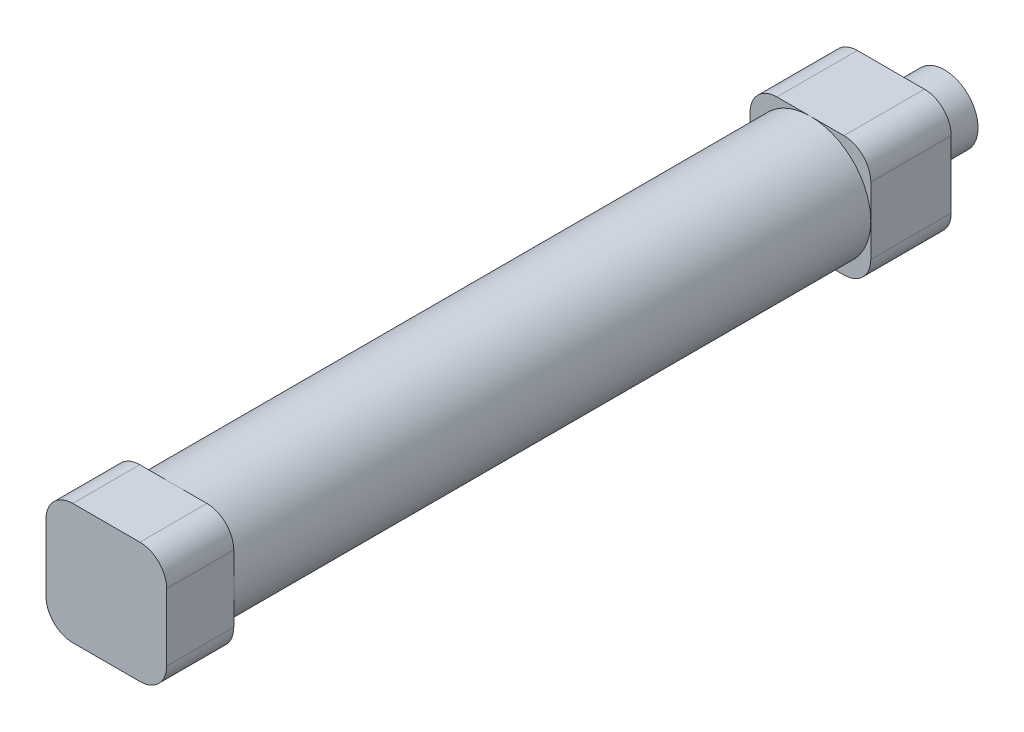
ISO-10303-21;
HEADER;
FILE_DESCRIPTION(('STEP AP214'),'2;1');
FILE_NAME('part.step','',(''),(''),'','','');
FILE_SCHEMA(('AUTOMOTIVE_DESIGN { 1 0 10303 214 1 1 1 1 }'));
ENDSEC;
DATA;
#1=APPLICATION_CONTEXT('core data for automotive mechanical design processes');
#2=APPLICATION_PROTOCOL_DEFINITION('international standard','automotive_design',2000,#1);
#3=PRODUCT_CONTEXT('',#1,'mechanical');
#4=PRODUCT('Part','Part','',(#3));
#5=PRODUCT_RELATED_PRODUCT_CATEGORY('part','',(#4));
#6=PRODUCT_DEFINITION_FORMATION('','',#4);
#7=PRODUCT_DEFINITION_CONTEXT('part definition',#1,'design');
#8=PRODUCT_DEFINITION('design','',#6,#7);
#9=PRODUCT_DEFINITION_SHAPE('','',#8);
#10=(LENGTH_UNIT() NAMED_UNIT(*) SI_UNIT(.MILLI.,.METRE.));
#11=(NAMED_UNIT(*) PLANE_ANGLE_UNIT() SI_UNIT($,.RADIAN.));
#12=(NAMED_UNIT(*) SI_UNIT($,.STERADIAN.) SOLID_ANGLE_UNIT());
#13=UNCERTAINTY_MEASURE_WITH_UNIT(LENGTH_MEASURE(1.E-05),#10,'distance_accuracy_value','');
#14=(GEOMETRIC_REPRESENTATION_CONTEXT(3) GLOBAL_UNCERTAINTY_ASSIGNED_CONTEXT((#13)) GLOBAL_UNIT_ASSIGNED_CONTEXT((#10,
#11,#12)) REPRESENTATION_CONTEXT('',''));
#15=CARTESIAN_POINT('',(0.,0.,0.));
#16=DIRECTION('',(0.,0.,1.));
#17=DIRECTION('',(1.,0.,0.));
#18=AXIS2_PLACEMENT_3D('',#15,#16,#17);
#19=CARTESIAN_POINT('',(4.99999999999999,-5.,0.));
#20=DIRECTION('',(0.,0.,-1.));
#21=DIRECTION('',(-1.,0.,0.));
#22=AXIS2_PLACEMENT_3D('',#19,#20,#21);
#23=PLANE('',#22);
#24=CARTESIAN_POINT('',(0.,0.,0.));
#25=DIRECTION('',(0.,0.,-1.));
#26=DIRECTION('',(-1.,0.,0.));
#27=AXIS2_PLACEMENT_3D('',#24,#25,#26);
#28=CIRCLE('',#27,2.5);
#29=CARTESIAN_POINT('',(-2.5,0.,0.));
#30=VERTEX_POINT('',#29);
#31=EDGE_CURVE('E39',#30,#30,#28,.T.);
#32=ORIENTED_EDGE('',*,*,#31,.T.);
#33=EDGE_LOOP('',(#32));
#34=FACE_BOUND('',#33,.T.);
#35=CARTESIAN_POINT('',(0.,0.,0.));
#36=DIRECTION('',(0.,0.,1.));
#37=DIRECTION('',(1.,0.,0.));
#38=AXIS2_PLACEMENT_3D('',#35,#36,#37);
#39=CIRCLE('',#38,8.);
#40=CARTESIAN_POINT('',(8.,0.,0.));
#41=VERTEX_POINT('',#40);
#42=EDGE_CURVE('E275',#41,#41,#39,.T.);
#43=ORIENTED_EDGE('',*,*,#42,.T.);
#44=EDGE_LOOP('',(#43));
#45=FACE_BOUND('',#44,.T.);
#46=ADVANCED_FACE('F35',(#34,#45),#23,.F.);
#47=CARTESIAN_POINT('',(-5.,5.,95.));
#48=DIRECTION('',(0.,0.,1.));
#49=DIRECTION('',(1.,0.,0.));
#50=AXIS2_PLACEMENT_3D('',#47,#48,#49);
#51=PLANE('',#50);
#52=CARTESIAN_POINT('',(0.,0.,95.));
#53=DIRECTION('',(0.,0.,1.));
#54=DIRECTION('',(1.,0.,0.));
#55=AXIS2_PLACEMENT_3D('',#52,#53,#54);
#56=CIRCLE('',#55,8.);
#57=CARTESIAN_POINT('',(8.,0.,95.));
#58=VERTEX_POINT('',#57);
#59=EDGE_CURVE('E272',#58,#58,#56,.T.);
#60=ORIENTED_EDGE('',*,*,#59,.F.);
#61=EDGE_LOOP('',(#60));
#62=FACE_BOUND('',#61,.T.);
#63=ADVANCED_FACE('F365',(#62),#51,.F.);
#64=CARTESIAN_POINT('',(0.,0.,95.));
#65=DIRECTION('',(0.,0.,-1.));
#66=DIRECTION('',(-1.,0.,0.));
#67=AXIS2_PLACEMENT_3D('',#64,#65,#66);
#68=CYLINDRICAL_SURFACE('',#67,8.);
#69=ORIENTED_EDGE('',*,*,#59,.T.);
#70=EDGE_LOOP('',(#69));
#71=FACE_BOUND('',#70,.T.);
#72=ORIENTED_EDGE('',*,*,#42,.F.);
#73=EDGE_LOOP('',(#72));
#74=FACE_BOUND('',#73,.T.);
#75=ADVANCED_FACE('F372',(#71,#74),#68,.F.);
#76=CARTESIAN_POINT('',(0.,0.,18.));
#77=DIRECTION('',(0.,0.,-1.));
#78=DIRECTION('',(-1.,0.,0.));
#79=AXIS2_PLACEMENT_3D('',#76,#77,#78);
#80=CYLINDRICAL_SURFACE('',#79,2.5);
#81=CARTESIAN_POINT('',(0.,0.,-20.));
#82=DIRECTION('',(0.,0.,-1.));
#83=DIRECTION('',(-1.,0.,0.));
#84=AXIS2_PLACEMENT_3D('',#81,#82,#83);
#85=CIRCLE('',#84,2.5);
#86=CARTESIAN_POINT('',(-2.5,0.,-20.));
#87=VERTEX_POINT('',#86);
#88=EDGE_CURVE('E563',#87,#87,#85,.T.);
#89=ORIENTED_EDGE('',*,*,#88,.T.);
#90=EDGE_LOOP('',(#89));
#91=FACE_BOUND('',#90,.T.);
#92=ORIENTED_EDGE('',*,*,#31,.F.);
#93=EDGE_LOOP('',(#92));
#94=FACE_BOUND('',#93,.T.);
#95=ADVANCED_FACE('F454',(#91,#94),#80,.F.);
#96=CARTESIAN_POINT('',(4.99999999999999,-5.,-12.));
#97=DIRECTION('',(0.,0.,-1.));
#98=DIRECTION('',(-1.,0.,0.));
#99=AXIS2_PLACEMENT_3D('',#96,#97,#98);
#100=PLANE('',#99);
#101=CARTESIAN_POINT('',(4.99999999999999,-5.,-12.));
#102=DIRECTION('',(0.,0.,-1.));
#103=DIRECTION('',(-1.,0.,0.));
#104=AXIS2_PLACEMENT_3D('',#101,#102,#103);
#105=CIRCLE('',#104,4.);
#106=CARTESIAN_POINT('',(8.99999999999999,-5.,-12.));
#107=VERTEX_POINT('',#106);
#108=CARTESIAN_POINT('',(4.99999999999999,-9.,-12.));
#109=VERTEX_POINT('',#108);
#110=EDGE_CURVE('E187',#107,#109,#105,.T.);
#111=ORIENTED_EDGE('',*,*,#110,.T.);
#112=DIRECTION('',(-1.,0.,0.));
#113=VECTOR('',#112,1.);
#114=CARTESIAN_POINT('',(4.99999999999999,-9.,-12.));
#115=LINE('',#114,#113);
#116=CARTESIAN_POINT('',(-5.00000000000001,-9.,-12.));
#117=VERTEX_POINT('',#116);
#118=EDGE_CURVE('E175',#109,#117,#115,.T.);
#119=ORIENTED_EDGE('',*,*,#118,.T.);
#120=CARTESIAN_POINT('',(-5.00000000000001,-5.,-12.));
#121=DIRECTION('',(0.,0.,-1.));
#122=DIRECTION('',(-1.,0.,0.));
#123=AXIS2_PLACEMENT_3D('',#120,#121,#122);
#124=CIRCLE('',#123,4.);
#125=CARTESIAN_POINT('',(-9.00000000000001,-5.,-12.));
#126=VERTEX_POINT('',#125);
#127=EDGE_CURVE('E186',#117,#126,#124,.T.);
#128=ORIENTED_EDGE('',*,*,#127,.T.);
#129=DIRECTION('',(0.,1.,0.));
#130=VECTOR('',#129,1.);
#131=CARTESIAN_POINT('',(-9.00000000000001,-5.,-12.));
#132=LINE('',#131,#130);
#133=CARTESIAN_POINT('',(-9.00000000000001,5.,-12.));
#134=VERTEX_POINT('',#133);
#135=EDGE_CURVE('E341',#126,#134,#132,.T.);
#136=ORIENTED_EDGE('',*,*,#135,.T.);
#137=CARTESIAN_POINT('',(-5.00000000000001,5.,-12.));
#138=DIRECTION('',(0.,0.,-1.));
#139=DIRECTION('',(-1.,0.,0.));
#140=AXIS2_PLACEMENT_3D('',#137,#138,#139);
#141=CIRCLE('',#140,4.);
#142=CARTESIAN_POINT('',(-5.00000000000001,9.,-12.));
#143=VERTEX_POINT('',#142);
#144=EDGE_CURVE('E340',#134,#143,#141,.T.);
#145=ORIENTED_EDGE('',*,*,#144,.T.);
#146=DIRECTION('',(1.,0.,0.));
#147=VECTOR('',#146,1.);
#148=CARTESIAN_POINT('',(4.99999999999999,9.,-12.));
#149=LINE('',#148,#147);
#150=CARTESIAN_POINT('',(4.99999999999999,9.,-12.));
#151=VERTEX_POINT('',#150);
#152=EDGE_CURVE('E343',#143,#151,#149,.T.);
#153=ORIENTED_EDGE('',*,*,#152,.T.);
#154=CARTESIAN_POINT('',(4.99999999999999,5.,-12.));
#155=DIRECTION('',(0.,0.,-1.));
#156=DIRECTION('',(-1.,0.,0.));
#157=AXIS2_PLACEMENT_3D('',#154,#155,#156);
#158=CIRCLE('',#157,4.);
#159=CARTESIAN_POINT('',(8.99999999999999,5.,-12.));
#160=VERTEX_POINT('',#159);
#161=EDGE_CURVE('E348',#151,#160,#158,.T.);
#162=ORIENTED_EDGE('',*,*,#161,.T.);
#163=DIRECTION('',(0.,-1.,0.));
#164=VECTOR('',#163,1.);
#165=CARTESIAN_POINT('',(8.99999999999999,-5.,-12.));
#166=LINE('',#165,#164);
#167=EDGE_CURVE('E193',#160,#107,#166,.T.);
#168=ORIENTED_EDGE('',*,*,#167,.T.);
#169=EDGE_LOOP('',(#111,#119,#128,#136,#145,#153,#162,#168));
#170=FACE_BOUND('',#169,.T.);
#171=CARTESIAN_POINT('',(0.,0.,-12.));
#172=DIRECTION('',(0.,0.,-1.));
#173=DIRECTION('',(-1.,0.,0.));
#174=AXIS2_PLACEMENT_3D('',#171,#172,#173);
#175=CIRCLE('',#174,5.);
#176=CARTESIAN_POINT('',(-5.,0.,-12.));
#177=VERTEX_POINT('',#176);
#178=EDGE_CURVE('E569',#177,#177,#175,.T.);
#179=ORIENTED_EDGE('',*,*,#178,.F.);
#180=EDGE_LOOP('',(#179));
#181=FACE_BOUND('',#180,.T.);
#182=ADVANCED_FACE('F190',(#170,#181),#100,.T.);
#183=CARTESIAN_POINT('',(0.,0.,95.));
#184=DIRECTION('',(0.,0.,-1.));
#185=DIRECTION('',(-1.,0.,0.));
#186=AXIS2_PLACEMENT_3D('',#183,#184,#185);
#187=CYLINDRICAL_SURFACE('',#186,9.);
#188=CARTESIAN_POINT('',(0.,0.,95.));
#189=DIRECTION('',(0.,0.,1.));
#190=DIRECTION('',(1.,0.,0.));
#191=AXIS2_PLACEMENT_3D('',#188,#189,#190);
#192=CIRCLE('',#191,9.);
#193=CARTESIAN_POINT('',(9.,0.,95.));
#194=VERTEX_POINT('',#193);
#195=CARTESIAN_POINT('',(0.,9.,95.));
#196=VERTEX_POINT('',#195);
#197=EDGE_CURVE('E12',#194,#196,#192,.T.);
#198=ORIENTED_EDGE('',*,*,#197,.F.);
#199=CARTESIAN_POINT('',(0.,-9.,95.));
#200=VERTEX_POINT('',#199);
#201=EDGE_CURVE('E46',#200,#194,#192,.T.);
#202=ORIENTED_EDGE('',*,*,#201,.F.);
#203=CARTESIAN_POINT('',(-9.,0.,95.));
#204=VERTEX_POINT('',#203);
#205=EDGE_CURVE('E285',#204,#200,#192,.T.);
#206=ORIENTED_EDGE('',*,*,#205,.F.);
#207=EDGE_CURVE('E44',#196,#204,#192,.T.);
#208=ORIENTED_EDGE('',*,*,#207,.F.);
#209=EDGE_LOOP('',(#198,#202,#206,#208));
#210=FACE_BOUND('',#209,.T.);
#211=CARTESIAN_POINT('',(0.,0.,0.));
#212=DIRECTION('',(0.,0.,1.));
#213=DIRECTION('',(1.,0.,0.));
#214=AXIS2_PLACEMENT_3D('',#211,#212,#213);
#215=CIRCLE('',#214,9.);
#216=CARTESIAN_POINT('',(8.99999999999999,0.,0.));
#217=VERTEX_POINT('',#216);
#218=CARTESIAN_POINT('',(0.,9.,0.));
#219=VERTEX_POINT('',#218);
#220=EDGE_CURVE('E278',#217,#219,#215,.T.);
#221=ORIENTED_EDGE('',*,*,#220,.T.);
#222=CARTESIAN_POINT('',(-9.00000000000001,0.,0.));
#223=VERTEX_POINT('',#222);
#224=EDGE_CURVE('E280',#219,#223,#215,.T.);
#225=ORIENTED_EDGE('',*,*,#224,.T.);
#226=CARTESIAN_POINT('',(0.,-9.,0.));
#227=VERTEX_POINT('',#226);
#228=EDGE_CURVE('E286',#223,#227,#215,.T.);
#229=ORIENTED_EDGE('',*,*,#228,.T.);
#230=EDGE_CURVE('E277',#227,#217,#215,.T.);
#231=ORIENTED_EDGE('',*,*,#230,.T.);
#232=EDGE_LOOP('',(#221,#225,#229,#231));
#233=FACE_BOUND('',#232,.T.);
#234=ADVANCED_FACE('F37',(#210,#233),#187,.T.);
#235=DIRECTION('',(0.,1.,0.));
#236=VECTOR('',#235,1.);
#237=CARTESIAN_POINT('',(9.,-5.,95.));
#238=LINE('',#237,#236);
#239=CARTESIAN_POINT('',(9.,5.,95.));
#240=VERTEX_POINT('',#239);
#241=EDGE_CURVE('E240',#194,#240,#238,.T.);
#242=ORIENTED_EDGE('',*,*,#241,.F.);
#243=ORIENTED_EDGE('',*,*,#197,.T.);
#244=DIRECTION('',(-1.,0.,0.));
#245=VECTOR('',#244,1.);
#246=CARTESIAN_POINT('',(-5.,9.,95.));
#247=LINE('',#246,#245);
#248=CARTESIAN_POINT('',(5.,9.,95.));
#249=VERTEX_POINT('',#248);
#250=EDGE_CURVE('E214',#249,#196,#247,.T.);
#251=ORIENTED_EDGE('',*,*,#250,.F.);
#252=CARTESIAN_POINT('',(5.,5.,95.));
#253=DIRECTION('',(0.,0.,1.));
#254=DIRECTION('',(1.,0.,0.));
#255=AXIS2_PLACEMENT_3D('',#252,#253,#254);
#256=CIRCLE('',#255,4.);
#257=EDGE_CURVE('E244',#240,#249,#256,.T.);
#258=ORIENTED_EDGE('',*,*,#257,.F.);
#259=EDGE_LOOP('',(#242,#243,#251,#258));
#260=FACE_BOUND('',#259,.T.);
#261=ADVANCED_FACE('F375',(#260),#51,.F.);
#262=CARTESIAN_POINT('',(-5.,9.,95.));
#263=VERTEX_POINT('',#262);
#264=EDGE_CURVE('E246',#196,#263,#247,.T.);
#265=ORIENTED_EDGE('',*,*,#264,.F.);
#266=ORIENTED_EDGE('',*,*,#207,.T.);
#267=DIRECTION('',(0.,-1.,0.));
#268=VECTOR('',#267,1.);
#269=CARTESIAN_POINT('',(-9.,-5.,95.));
#270=LINE('',#269,#268);
#271=CARTESIAN_POINT('',(-9.,5.,95.));
#272=VERTEX_POINT('',#271);
#273=EDGE_CURVE('E229',#272,#204,#270,.T.);
#274=ORIENTED_EDGE('',*,*,#273,.F.);
#275=CARTESIAN_POINT('',(-5.,5.,95.));
#276=DIRECTION('',(0.,0.,1.));
#277=DIRECTION('',(1.,0.,0.));
#278=AXIS2_PLACEMENT_3D('',#275,#276,#277);
#279=CIRCLE('',#278,4.);
#280=EDGE_CURVE('E201',#263,#272,#279,.T.);
#281=ORIENTED_EDGE('',*,*,#280,.F.);
#282=EDGE_LOOP('',(#265,#266,#274,#281));
#283=FACE_BOUND('',#282,.T.);
#284=ADVANCED_FACE('F591',(#283),#51,.F.);
#285=CARTESIAN_POINT('',(-9.,-5.,95.));
#286=VERTEX_POINT('',#285);
#287=EDGE_CURVE('E204',#204,#286,#270,.T.);
#288=ORIENTED_EDGE('',*,*,#287,.F.);
#289=ORIENTED_EDGE('',*,*,#205,.T.);
#290=DIRECTION('',(1.,0.,0.));
#291=VECTOR('',#290,1.);
#292=CARTESIAN_POINT('',(-5.,-9.,95.));
#293=LINE('',#292,#291);
#294=CARTESIAN_POINT('',(-5.,-9.,95.));
#295=VERTEX_POINT('',#294);
#296=EDGE_CURVE('E235',#295,#200,#293,.T.);
#297=ORIENTED_EDGE('',*,*,#296,.F.);
#298=CARTESIAN_POINT('',(-5.,-5.,95.));
#299=DIRECTION('',(0.,0.,1.));
#300=DIRECTION('',(1.,0.,0.));
#301=AXIS2_PLACEMENT_3D('',#298,#299,#300);
#302=CIRCLE('',#301,4.);
#303=EDGE_CURVE('E232',#286,#295,#302,.T.);
#304=ORIENTED_EDGE('',*,*,#303,.F.);
#305=EDGE_LOOP('',(#288,#289,#297,#304));
#306=FACE_BOUND('',#305,.T.);
#307=ADVANCED_FACE('F594',(#306),#51,.F.);
#308=CARTESIAN_POINT('',(5.,-9.,95.));
#309=VERTEX_POINT('',#308);
#310=EDGE_CURVE('E234',#200,#309,#293,.T.);
#311=ORIENTED_EDGE('',*,*,#310,.F.);
#312=ORIENTED_EDGE('',*,*,#201,.T.);
#313=CARTESIAN_POINT('',(9.,-5.,95.));
#314=VERTEX_POINT('',#313);
#315=EDGE_CURVE('E241',#314,#194,#238,.T.);
#316=ORIENTED_EDGE('',*,*,#315,.F.);
#317=CARTESIAN_POINT('',(5.,-5.,95.));
#318=DIRECTION('',(0.,0.,1.));
#319=DIRECTION('',(-1.,0.,0.));
#320=AXIS2_PLACEMENT_3D('',#317,#318,#319);
#321=CIRCLE('',#320,4.);
#322=EDGE_CURVE('E238',#309,#314,#321,.T.);
#323=ORIENTED_EDGE('',*,*,#322,.F.);
#324=EDGE_LOOP('',(#311,#312,#316,#323));
#325=FACE_BOUND('',#324,.T.);
#326=ADVANCED_FACE('F376',(#325),#51,.F.);
#327=CARTESIAN_POINT('',(-5.,5.,105.));
#328=DIRECTION('',(0.,0.,-1.));
#329=DIRECTION('',(-1.,0.,0.));
#330=AXIS2_PLACEMENT_3D('',#327,#328,#329);
#331=CYLINDRICAL_SURFACE('',#330,4.);
#332=ORIENTED_EDGE('',*,*,#280,.T.);
#333=DIRECTION('',(0.,0.,-1.));
#334=VECTOR('',#333,1.);
#335=CARTESIAN_POINT('',(-9.,5.,105.));
#336=LINE('',#335,#334);
#337=CARTESIAN_POINT('',(-9.,5.,105.));
#338=VERTEX_POINT('',#337);
#339=EDGE_CURVE('E269',#338,#272,#336,.T.);
#340=ORIENTED_EDGE('',*,*,#339,.F.);
#341=CARTESIAN_POINT('',(-5.,5.,105.));
#342=DIRECTION('',(0.,0.,1.));
#343=DIRECTION('',(1.,0.,0.));
#344=AXIS2_PLACEMENT_3D('',#341,#342,#343);
#345=CIRCLE('',#344,4.);
#346=CARTESIAN_POINT('',(-5.,9.,105.));
#347=VERTEX_POINT('',#346);
#348=EDGE_CURVE('E210',#347,#338,#345,.T.);
#349=ORIENTED_EDGE('',*,*,#348,.F.);
#350=DIRECTION('',(0.,0.,-1.));
#351=VECTOR('',#350,1.);
#352=CARTESIAN_POINT('',(-5.,9.,105.));
#353=LINE('',#352,#351);
#354=EDGE_CURVE('E227',#347,#263,#353,.T.);
#355=ORIENTED_EDGE('',*,*,#354,.T.);
#356=EDGE_LOOP('',(#332,#340,#349,#355));
#357=FACE_BOUND('',#356,.T.);
#358=ADVANCED_FACE('F498',(#357),#331,.T.);
#359=CARTESIAN_POINT('',(-9.,-5.,105.));
#360=DIRECTION('',(1.,0.,0.));
#361=DIRECTION('',(0.,0.,-1.));
#362=AXIS2_PLACEMENT_3D('',#359,#360,#361);
#363=PLANE('',#362);
#364=CARTESIAN_POINT('',(-9.00000000000001,0.,99.));
#365=DIRECTION('',(-1.,0.,0.));
#366=DIRECTION('',(0.,0.,1.));
#367=AXIS2_PLACEMENT_3D('',#364,#365,#366);
#368=CIRCLE('',#367,1.98051649837292);
#369=CARTESIAN_POINT('',(-9.00000000000001,0.,100.980516498373));
#370=VERTEX_POINT('',#369);
#371=EDGE_CURVE('E554',#370,#370,#368,.T.);
#372=ORIENTED_EDGE('',*,*,#371,.F.);
#373=EDGE_LOOP('',(#372));
#374=FACE_BOUND('',#373,.T.);
#375=ORIENTED_EDGE('',*,*,#273,.T.);
#376=ORIENTED_EDGE('',*,*,#287,.T.);
#377=DIRECTION('',(0.,0.,-1.));
#378=VECTOR('',#377,1.);
#379=CARTESIAN_POINT('',(-9.,-5.,105.));
#380=LINE('',#379,#378);
#381=CARTESIAN_POINT('',(-9.,-5.,105.));
#382=VERTEX_POINT('',#381);
#383=EDGE_CURVE('E266',#382,#286,#380,.T.);
#384=ORIENTED_EDGE('',*,*,#383,.F.);
#385=DIRECTION('',(0.,-1.,0.));
#386=VECTOR('',#385,1.);
#387=CARTESIAN_POINT('',(-9.,-5.,105.));
#388=LINE('',#387,#386);
#389=EDGE_CURVE('E213',#338,#382,#388,.T.);
#390=ORIENTED_EDGE('',*,*,#389,.F.);
#391=ORIENTED_EDGE('',*,*,#339,.T.);
#392=EDGE_LOOP('',(#375,#376,#384,#390,#391));
#393=FACE_BOUND('',#392,.T.);
#394=ADVANCED_FACE('F493',(#374,#393),#363,.F.);
#395=CARTESIAN_POINT('',(-5.,-5.,105.));
#396=DIRECTION('',(0.,0.,-1.));
#397=DIRECTION('',(-1.,0.,0.));
#398=AXIS2_PLACEMENT_3D('',#395,#396,#397);
#399=CYLINDRICAL_SURFACE('',#398,4.);
#400=ORIENTED_EDGE('',*,*,#303,.T.);
#401=DIRECTION('',(0.,0.,-1.));
#402=VECTOR('',#401,1.);
#403=CARTESIAN_POINT('',(-5.,-9.,105.));
#404=LINE('',#403,#402);
#405=CARTESIAN_POINT('',(-5.,-9.,105.));
#406=VERTEX_POINT('',#405);
#407=EDGE_CURVE('E263',#406,#295,#404,.T.);
#408=ORIENTED_EDGE('',*,*,#407,.F.);
#409=CARTESIAN_POINT('',(-5.,-5.,105.));
#410=DIRECTION('',(0.,0.,1.));
#411=DIRECTION('',(1.,0.,0.));
#412=AXIS2_PLACEMENT_3D('',#409,#410,#411);
#413=CIRCLE('',#412,4.);
#414=EDGE_CURVE('E216',#382,#406,#413,.T.);
#415=ORIENTED_EDGE('',*,*,#414,.F.);
#416=ORIENTED_EDGE('',*,*,#383,.T.);
#417=EDGE_LOOP('',(#400,#408,#415,#416));
#418=FACE_BOUND('',#417,.T.);
#419=ADVANCED_FACE('F497',(#418),#399,.T.);
#420=CARTESIAN_POINT('',(-5.,-9.,105.));
#421=DIRECTION('',(0.,1.,0.));
#422=DIRECTION('',(0.,0.,1.));
#423=AXIS2_PLACEMENT_3D('',#420,#421,#422);
#424=PLANE('',#423);
#425=ORIENTED_EDGE('',*,*,#296,.T.);
#426=ORIENTED_EDGE('',*,*,#310,.T.);
#427=DIRECTION('',(0.,0.,-1.));
#428=VECTOR('',#427,1.);
#429=CARTESIAN_POINT('',(5.,-9.,105.));
#430=LINE('',#429,#428);
#431=CARTESIAN_POINT('',(5.,-9.,105.));
#432=VERTEX_POINT('',#431);
#433=EDGE_CURVE('E260',#432,#309,#430,.T.);
#434=ORIENTED_EDGE('',*,*,#433,.F.);
#435=DIRECTION('',(1.,0.,0.));
#436=VECTOR('',#435,1.);
#437=CARTESIAN_POINT('',(-5.,-9.,105.));
#438=LINE('',#437,#436);
#439=EDGE_CURVE('E218',#406,#432,#438,.T.);
#440=ORIENTED_EDGE('',*,*,#439,.F.);
#441=ORIENTED_EDGE('',*,*,#407,.T.);
#442=EDGE_LOOP('',(#425,#426,#434,#440,#441));
#443=FACE_BOUND('',#442,.T.);
#444=ADVANCED_FACE('F602',(#443),#424,.F.);
#445=CARTESIAN_POINT('',(5.,-5.,105.));
#446=DIRECTION('',(0.,0.,-1.));
#447=DIRECTION('',(-1.,0.,0.));
#448=AXIS2_PLACEMENT_3D('',#445,#446,#447);
#449=CYLINDRICAL_SURFACE('',#448,4.);
#450=ORIENTED_EDGE('',*,*,#322,.T.);
#451=DIRECTION('',(0.,0.,-1.));
#452=VECTOR('',#451,1.);
#453=CARTESIAN_POINT('',(9.,-5.,105.));
#454=LINE('',#453,#452);
#455=CARTESIAN_POINT('',(9.,-5.,105.));
#456=VERTEX_POINT('',#455);
#457=EDGE_CURVE('E257',#456,#314,#454,.T.);
#458=ORIENTED_EDGE('',*,*,#457,.F.);
#459=CARTESIAN_POINT('',(5.,-5.,105.));
#460=DIRECTION('',(0.,0.,1.));
#461=DIRECTION('',(-1.,0.,0.));
#462=AXIS2_PLACEMENT_3D('',#459,#460,#461);
#463=CIRCLE('',#462,4.);
#464=EDGE_CURVE('E220',#432,#456,#463,.T.);
#465=ORIENTED_EDGE('',*,*,#464,.F.);
#466=ORIENTED_EDGE('',*,*,#433,.T.);
#467=EDGE_LOOP('',(#450,#458,#465,#466));
#468=FACE_BOUND('',#467,.T.);
#469=ADVANCED_FACE('F620',(#468),#449,.T.);
#470=CARTESIAN_POINT('',(9.,-5.,105.));
#471=DIRECTION('',(-1.,0.,0.));
#472=DIRECTION('',(0.,-1.,0.));
#473=AXIS2_PLACEMENT_3D('',#470,#471,#472);
#474=PLANE('',#473);
#475=ORIENTED_EDGE('',*,*,#315,.T.);
#476=ORIENTED_EDGE('',*,*,#241,.T.);
#477=DIRECTION('',(0.,0.,-1.));
#478=VECTOR('',#477,1.);
#479=CARTESIAN_POINT('',(9.,5.,105.));
#480=LINE('',#479,#478);
#481=CARTESIAN_POINT('',(9.,5.,105.));
#482=VERTEX_POINT('',#481);
#483=EDGE_CURVE('E254',#482,#240,#480,.T.);
#484=ORIENTED_EDGE('',*,*,#483,.F.);
#485=DIRECTION('',(0.,1.,0.));
#486=VECTOR('',#485,1.);
#487=CARTESIAN_POINT('',(9.,-5.,105.));
#488=LINE('',#487,#486);
#489=EDGE_CURVE('E222',#456,#482,#488,.T.);
#490=ORIENTED_EDGE('',*,*,#489,.F.);
#491=ORIENTED_EDGE('',*,*,#457,.T.);
#492=EDGE_LOOP('',(#475,#476,#484,#490,#491));
#493=FACE_BOUND('',#492,.T.);
#494=ADVANCED_FACE('F624',(#493),#474,.F.);
#495=CARTESIAN_POINT('',(5.,5.,105.));
#496=DIRECTION('',(0.,0.,-1.));
#497=DIRECTION('',(-1.,0.,0.));
#498=AXIS2_PLACEMENT_3D('',#495,#496,#497);
#499=CYLINDRICAL_SURFACE('',#498,4.);
#500=ORIENTED_EDGE('',*,*,#257,.T.);
#501=DIRECTION('',(0.,0.,-1.));
#502=VECTOR('',#501,1.);
#503=CARTESIAN_POINT('',(5.,9.,105.));
#504=LINE('',#503,#502);
#505=CARTESIAN_POINT('',(5.,9.,105.));
#506=VERTEX_POINT('',#505);
#507=EDGE_CURVE('E251',#506,#249,#504,.T.);
#508=ORIENTED_EDGE('',*,*,#507,.F.);
#509=CARTESIAN_POINT('',(5.,5.,105.));
#510=DIRECTION('',(0.,0.,1.));
#511=DIRECTION('',(1.,0.,0.));
#512=AXIS2_PLACEMENT_3D('',#509,#510,#511);
#513=CIRCLE('',#512,4.);
#514=EDGE_CURVE('E224',#482,#506,#513,.T.);
#515=ORIENTED_EDGE('',*,*,#514,.F.);
#516=ORIENTED_EDGE('',*,*,#483,.T.);
#517=EDGE_LOOP('',(#500,#508,#515,#516));
#518=FACE_BOUND('',#517,.T.);
#519=ADVANCED_FACE('F627',(#518),#499,.T.);
#520=CARTESIAN_POINT('',(-5.,9.,105.));
#521=DIRECTION('',(0.,-1.,0.));
#522=DIRECTION('',(0.,0.,-1.));
#523=AXIS2_PLACEMENT_3D('',#520,#521,#522);
#524=PLANE('',#523);
#525=ORIENTED_EDGE('',*,*,#250,.T.);
#526=ORIENTED_EDGE('',*,*,#264,.T.);
#527=ORIENTED_EDGE('',*,*,#354,.F.);
#528=DIRECTION('',(-1.,0.,0.));
#529=VECTOR('',#528,1.);
#530=CARTESIAN_POINT('',(-5.,9.,105.));
#531=LINE('',#530,#529);
#532=EDGE_CURVE('E226',#506,#347,#531,.T.);
#533=ORIENTED_EDGE('',*,*,#532,.F.);
#534=ORIENTED_EDGE('',*,*,#507,.T.);
#535=EDGE_LOOP('',(#525,#526,#527,#533,#534));
#536=FACE_BOUND('',#535,.T.);
#537=ADVANCED_FACE('F400',(#536),#524,.F.);
#538=CARTESIAN_POINT('',(-5.,5.,105.));
#539=DIRECTION('',(0.,0.,1.));
#540=DIRECTION('',(1.,0.,0.));
#541=AXIS2_PLACEMENT_3D('',#538,#539,#540);
#542=PLANE('',#541);
#543=ORIENTED_EDGE('',*,*,#348,.T.);
#544=ORIENTED_EDGE('',*,*,#389,.T.);
#545=ORIENTED_EDGE('',*,*,#414,.T.);
#546=ORIENTED_EDGE('',*,*,#439,.T.);
#547=ORIENTED_EDGE('',*,*,#464,.T.);
#548=ORIENTED_EDGE('',*,*,#489,.T.);
#549=ORIENTED_EDGE('',*,*,#514,.T.);
#550=ORIENTED_EDGE('',*,*,#532,.T.);
#551=EDGE_LOOP('',(#543,#544,#545,#546,#547,#548,#549,#550));
#552=FACE_BOUND('',#551,.T.);
#553=ADVANCED_FACE('F395',(#552),#542,.T.);
#554=ORIENTED_EDGE('',*,*,#220,.F.);
#555=DIRECTION('',(0.,-1.,0.));
#556=VECTOR('',#555,1.);
#557=CARTESIAN_POINT('',(8.99999999999999,-5.,0.));
#558=LINE('',#557,#556);
#559=CARTESIAN_POINT('',(8.99999999999999,5.,0.));
#560=VERTEX_POINT('',#559);
#561=EDGE_CURVE('E53',#560,#217,#558,.T.);
#562=ORIENTED_EDGE('',*,*,#561,.F.);
#563=CARTESIAN_POINT('',(4.99999999999999,5.,0.));
#564=DIRECTION('',(0.,0.,-1.));
#565=DIRECTION('',(-1.,0.,0.));
#566=AXIS2_PLACEMENT_3D('',#563,#564,#565);
#567=CIRCLE('',#566,4.);
#568=CARTESIAN_POINT('',(4.99999999999999,9.,0.));
#569=VERTEX_POINT('',#568);
#570=EDGE_CURVE('E321',#569,#560,#567,.T.);
#571=ORIENTED_EDGE('',*,*,#570,.F.);
#572=DIRECTION('',(1.,0.,0.));
#573=VECTOR('',#572,1.);
#574=CARTESIAN_POINT('',(4.99999999999999,9.,0.));
#575=LINE('',#574,#573);
#576=EDGE_CURVE('E313',#219,#569,#575,.T.);
#577=ORIENTED_EDGE('',*,*,#576,.F.);
#578=EDGE_LOOP('',(#554,#562,#571,#577));
#579=FACE_BOUND('',#578,.T.);
#580=ADVANCED_FACE('F385',(#579),#23,.F.);
#581=ORIENTED_EDGE('',*,*,#224,.F.);
#582=CARTESIAN_POINT('',(-5.00000000000001,9.,0.));
#583=VERTEX_POINT('',#582);
#584=EDGE_CURVE('E318',#583,#219,#575,.T.);
#585=ORIENTED_EDGE('',*,*,#584,.F.);
#586=CARTESIAN_POINT('',(-5.00000000000001,5.,0.));
#587=DIRECTION('',(0.,0.,-1.));
#588=DIRECTION('',(-1.,0.,0.));
#589=AXIS2_PLACEMENT_3D('',#586,#587,#588);
#590=CIRCLE('',#589,4.);
#591=CARTESIAN_POINT('',(-9.00000000000001,5.,0.));
#592=VERTEX_POINT('',#591);
#593=EDGE_CURVE('E303',#592,#583,#590,.T.);
#594=ORIENTED_EDGE('',*,*,#593,.F.);
#595=DIRECTION('',(0.,1.,0.));
#596=VECTOR('',#595,1.);
#597=CARTESIAN_POINT('',(-9.00000000000001,-5.,0.));
#598=LINE('',#597,#596);
#599=EDGE_CURVE('E299',#223,#592,#598,.T.);
#600=ORIENTED_EDGE('',*,*,#599,.F.);
#601=EDGE_LOOP('',(#581,#585,#594,#600));
#602=FACE_BOUND('',#601,.T.);
#603=ADVANCED_FACE('F300',(#602),#23,.F.);
#604=ORIENTED_EDGE('',*,*,#228,.F.);
#605=CARTESIAN_POINT('',(-9.00000000000001,-5.,0.));
#606=VERTEX_POINT('',#605);
#607=EDGE_CURVE('E295',#606,#223,#598,.T.);
#608=ORIENTED_EDGE('',*,*,#607,.F.);
#609=CARTESIAN_POINT('',(-5.00000000000001,-5.,0.));
#610=DIRECTION('',(0.,0.,-1.));
#611=DIRECTION('',(-1.,0.,0.));
#612=AXIS2_PLACEMENT_3D('',#609,#610,#611);
#613=CIRCLE('',#612,4.);
#614=CARTESIAN_POINT('',(-5.00000000000001,-9.,0.));
#615=VERTEX_POINT('',#614);
#616=EDGE_CURVE('E307',#615,#606,#613,.T.);
#617=ORIENTED_EDGE('',*,*,#616,.F.);
#618=DIRECTION('',(-1.,0.,0.));
#619=VECTOR('',#618,1.);
#620=CARTESIAN_POINT('',(4.99999999999999,-9.,0.));
#621=LINE('',#620,#619);
#622=EDGE_CURVE('E296',#227,#615,#621,.T.);
#623=ORIENTED_EDGE('',*,*,#622,.F.);
#624=EDGE_LOOP('',(#604,#608,#617,#623));
#625=FACE_BOUND('',#624,.T.);
#626=ADVANCED_FACE('F292',(#625),#23,.F.);
#627=CARTESIAN_POINT('',(4.99999999999999,-5.,-12.));
#628=DIRECTION('',(0.,0.,1.));
#629=DIRECTION('',(1.,0.,0.));
#630=AXIS2_PLACEMENT_3D('',#627,#628,#629);
#631=CYLINDRICAL_SURFACE('',#630,4.);
#632=CARTESIAN_POINT('',(4.99999999999999,-5.,0.));
#633=DIRECTION('',(0.,0.,-1.));
#634=DIRECTION('',(-1.,0.,0.));
#635=AXIS2_PLACEMENT_3D('',#632,#633,#634);
#636=CIRCLE('',#635,4.);
#637=CARTESIAN_POINT('',(8.99999999999999,-5.,0.));
#638=VERTEX_POINT('',#637);
#639=CARTESIAN_POINT('',(4.99999999999999,-9.,0.));
#640=VERTEX_POINT('',#639);
#641=EDGE_CURVE('E200',#638,#640,#636,.T.);
#642=ORIENTED_EDGE('',*,*,#641,.T.);
#643=DIRECTION('',(0.,0.,1.));
#644=VECTOR('',#643,1.);
#645=CARTESIAN_POINT('',(4.99999999999999,-9.,-12.));
#646=LINE('',#645,#644);
#647=EDGE_CURVE('E180',#109,#640,#646,.T.);
#648=ORIENTED_EDGE('',*,*,#647,.F.);
#649=ORIENTED_EDGE('',*,*,#110,.F.);
#650=DIRECTION('',(0.,0.,1.));
#651=VECTOR('',#650,1.);
#652=CARTESIAN_POINT('',(8.99999999999999,-5.,-12.));
#653=LINE('',#652,#651);
#654=EDGE_CURVE('E325',#107,#638,#653,.T.);
#655=ORIENTED_EDGE('',*,*,#654,.T.);
#656=EDGE_LOOP('',(#642,#648,#649,#655));
#657=FACE_BOUND('',#656,.T.);
#658=ADVANCED_FACE('F198',(#657),#631,.T.);
#659=CARTESIAN_POINT('',(4.99999999999999,-9.,-12.));
#660=DIRECTION('',(0.,1.,0.));
#661=DIRECTION('',(0.,0.,1.));
#662=AXIS2_PLACEMENT_3D('',#659,#660,#661);
#663=PLANE('',#662);
#664=EDGE_CURVE('E352',#640,#227,#621,.T.);
#665=ORIENTED_EDGE('',*,*,#664,.T.);
#666=ORIENTED_EDGE('',*,*,#622,.T.);
#667=DIRECTION('',(0.,0.,1.));
#668=VECTOR('',#667,1.);
#669=CARTESIAN_POINT('',(-5.00000000000001,-9.,-12.));
#670=LINE('',#669,#668);
#671=EDGE_CURVE('E183',#117,#615,#670,.T.);
#672=ORIENTED_EDGE('',*,*,#671,.F.);
#673=ORIENTED_EDGE('',*,*,#118,.F.);
#674=ORIENTED_EDGE('',*,*,#647,.T.);
#675=EDGE_LOOP('',(#665,#666,#672,#673,#674));
#676=FACE_BOUND('',#675,.T.);
#677=ADVANCED_FACE('F178',(#676),#663,.F.);
#678=CARTESIAN_POINT('',(-5.00000000000001,-5.,-12.));
#679=DIRECTION('',(0.,0.,1.));
#680=DIRECTION('',(1.,0.,0.));
#681=AXIS2_PLACEMENT_3D('',#678,#679,#680);
#682=CYLINDRICAL_SURFACE('',#681,4.);
#683=ORIENTED_EDGE('',*,*,#616,.T.);
#684=DIRECTION('',(0.,0.,1.));
#685=VECTOR('',#684,1.);
#686=CARTESIAN_POINT('',(-9.00000000000001,-5.,-12.));
#687=LINE('',#686,#685);
#688=EDGE_CURVE('E206',#126,#606,#687,.T.);
#689=ORIENTED_EDGE('',*,*,#688,.F.);
#690=ORIENTED_EDGE('',*,*,#127,.F.);
#691=ORIENTED_EDGE('',*,*,#671,.T.);
#692=EDGE_LOOP('',(#683,#689,#690,#691));
#693=FACE_BOUND('',#692,.T.);
#694=ADVANCED_FACE('F354',(#693),#682,.T.);
#695=CARTESIAN_POINT('',(-9.00000000000001,-5.,-12.));
#696=DIRECTION('',(1.,0.,0.));
#697=DIRECTION('',(0.,0.,-1.));
#698=AXIS2_PLACEMENT_3D('',#695,#696,#697);
#699=PLANE('',#698);
#700=CARTESIAN_POINT('',(-9.00000000000001,0.,-4.));
#701=DIRECTION('',(-1.,0.,0.));
#702=DIRECTION('',(0.,0.,1.));
#703=AXIS2_PLACEMENT_3D('',#700,#701,#702);
#704=CIRCLE('',#703,2.);
#705=CARTESIAN_POINT('',(-9.00000000000001,0.,-2.));
#706=VERTEX_POINT('',#705);
#707=EDGE_CURVE('E553',#706,#706,#704,.T.);
#708=ORIENTED_EDGE('',*,*,#707,.F.);
#709=EDGE_LOOP('',(#708));
#710=FACE_BOUND('',#709,.T.);
#711=ORIENTED_EDGE('',*,*,#607,.T.);
#712=ORIENTED_EDGE('',*,*,#599,.T.);
#713=DIRECTION('',(0.,0.,1.));
#714=VECTOR('',#713,1.);
#715=CARTESIAN_POINT('',(-9.00000000000001,5.,-12.));
#716=LINE('',#715,#714);
#717=EDGE_CURVE('E335',#134,#592,#716,.T.);
#718=ORIENTED_EDGE('',*,*,#717,.F.);
#719=ORIENTED_EDGE('',*,*,#135,.F.);
#720=ORIENTED_EDGE('',*,*,#688,.T.);
#721=EDGE_LOOP('',(#711,#712,#718,#719,#720));
#722=FACE_BOUND('',#721,.T.);
#723=ADVANCED_FACE('F310',(#710,#722),#699,.F.);
#724=CARTESIAN_POINT('',(-5.00000000000001,5.,-12.));
#725=DIRECTION('',(0.,0.,1.));
#726=DIRECTION('',(1.,0.,0.));
#727=AXIS2_PLACEMENT_3D('',#724,#725,#726);
#728=CYLINDRICAL_SURFACE('',#727,4.);
#729=ORIENTED_EDGE('',*,*,#593,.T.);
#730=DIRECTION('',(0.,0.,1.));
#731=VECTOR('',#730,1.);
#732=CARTESIAN_POINT('',(-5.00000000000001,9.,-12.));
#733=LINE('',#732,#731);
#734=EDGE_CURVE('E332',#143,#583,#733,.T.);
#735=ORIENTED_EDGE('',*,*,#734,.F.);
#736=ORIENTED_EDGE('',*,*,#144,.F.);
#737=ORIENTED_EDGE('',*,*,#717,.T.);
#738=EDGE_LOOP('',(#729,#735,#736,#737));
#739=FACE_BOUND('',#738,.T.);
#740=ADVANCED_FACE('F338',(#739),#728,.T.);
#741=CARTESIAN_POINT('',(4.99999999999999,9.,-12.));
#742=DIRECTION('',(0.,-1.,0.));
#743=DIRECTION('',(0.,0.,-1.));
#744=AXIS2_PLACEMENT_3D('',#741,#742,#743);
#745=PLANE('',#744);
#746=ORIENTED_EDGE('',*,*,#584,.T.);
#747=ORIENTED_EDGE('',*,*,#576,.T.);
#748=DIRECTION('',(0.,0.,1.));
#749=VECTOR('',#748,1.);
#750=CARTESIAN_POINT('',(4.99999999999999,9.,-12.));
#751=LINE('',#750,#749);
#752=EDGE_CURVE('E329',#151,#569,#751,.T.);
#753=ORIENTED_EDGE('',*,*,#752,.F.);
#754=ORIENTED_EDGE('',*,*,#152,.F.);
#755=ORIENTED_EDGE('',*,*,#734,.T.);
#756=EDGE_LOOP('',(#746,#747,#753,#754,#755));
#757=FACE_BOUND('',#756,.T.);
#758=ADVANCED_FACE('F406',(#757),#745,.F.);
#759=CARTESIAN_POINT('',(4.99999999999999,5.,-12.));
#760=DIRECTION('',(0.,0.,1.));
#761=DIRECTION('',(1.,0.,0.));
#762=AXIS2_PLACEMENT_3D('',#759,#760,#761);
#763=CYLINDRICAL_SURFACE('',#762,4.);
#764=ORIENTED_EDGE('',*,*,#570,.T.);
#765=DIRECTION('',(0.,0.,1.));
#766=VECTOR('',#765,1.);
#767=CARTESIAN_POINT('',(8.99999999999999,5.,-12.));
#768=LINE('',#767,#766);
#769=EDGE_CURVE('E327',#160,#560,#768,.T.);
#770=ORIENTED_EDGE('',*,*,#769,.F.);
#771=ORIENTED_EDGE('',*,*,#161,.F.);
#772=ORIENTED_EDGE('',*,*,#752,.T.);
#773=EDGE_LOOP('',(#764,#770,#771,#772));
#774=FACE_BOUND('',#773,.T.);
#775=ADVANCED_FACE('F411',(#774),#763,.T.);
#776=CARTESIAN_POINT('',(8.99999999999999,-5.,-12.));
#777=DIRECTION('',(-1.,0.,0.));
#778=DIRECTION('',(0.,0.,1.));
#779=AXIS2_PLACEMENT_3D('',#776,#777,#778);
#780=PLANE('',#779);
#781=ORIENTED_EDGE('',*,*,#561,.T.);
#782=EDGE_CURVE('E323',#217,#638,#558,.T.);
#783=ORIENTED_EDGE('',*,*,#782,.T.);
#784=ORIENTED_EDGE('',*,*,#654,.F.);
#785=ORIENTED_EDGE('',*,*,#167,.F.);
#786=ORIENTED_EDGE('',*,*,#769,.T.);
#787=EDGE_LOOP('',(#781,#783,#784,#785,#786));
#788=FACE_BOUND('',#787,.T.);
#789=ADVANCED_FACE('F383',(#788),#780,.F.);
#790=ORIENTED_EDGE('',*,*,#230,.F.);
#791=ORIENTED_EDGE('',*,*,#664,.F.);
#792=ORIENTED_EDGE('',*,*,#641,.F.);
#793=ORIENTED_EDGE('',*,*,#782,.F.);
#794=EDGE_LOOP('',(#790,#791,#792,#793));
#795=FACE_BOUND('',#794,.T.);
#796=ADVANCED_FACE('F368',(#795),#23,.F.);
#797=CARTESIAN_POINT('',(0.,0.,-20.));
#798=DIRECTION('',(0.,0.,1.));
#799=DIRECTION('',(1.,0.,0.));
#800=AXIS2_PLACEMENT_3D('',#797,#798,#799);
#801=CYLINDRICAL_SURFACE('',#800,5.);
#802=CARTESIAN_POINT('',(0.,0.,-20.));
#803=DIRECTION('',(0.,0.,-1.));
#804=DIRECTION('',(-1.,0.,0.));
#805=AXIS2_PLACEMENT_3D('',#802,#803,#804);
#806=CIRCLE('',#805,5.);
#807=CARTESIAN_POINT('',(-5.,0.,-20.));
#808=VERTEX_POINT('',#807);
#809=EDGE_CURVE('E351',#808,#808,#806,.T.);
#810=ORIENTED_EDGE('',*,*,#809,.F.);
#811=EDGE_LOOP('',(#810));
#812=FACE_BOUND('',#811,.T.);
#813=ORIENTED_EDGE('',*,*,#178,.T.);
#814=EDGE_LOOP('',(#813));
#815=FACE_BOUND('',#814,.T.);
#816=ADVANCED_FACE('F382',(#812,#815),#801,.T.);
#817=CARTESIAN_POINT('',(0.,0.,-20.));
#818=DIRECTION('',(0.,0.,-1.));
#819=DIRECTION('',(-1.,0.,0.));
#820=AXIS2_PLACEMENT_3D('',#817,#818,#819);
#821=PLANE('',#820);
#822=ORIENTED_EDGE('',*,*,#88,.F.);
#823=EDGE_LOOP('',(#822));
#824=FACE_BOUND('',#823,.T.);
#825=ORIENTED_EDGE('',*,*,#809,.T.);
#826=EDGE_LOOP('',(#825));
#827=FACE_BOUND('',#826,.T.);
#828=ADVANCED_FACE('F462',(#824,#827),#821,.T.);
#829=CARTESIAN_POINT('',(-6.00000000000001,0.,-4.));
#830=DIRECTION('',(-1.,0.,0.));
#831=DIRECTION('',(0.,0.,1.));
#832=AXIS2_PLACEMENT_3D('',#829,#830,#831);
#833=CYLINDRICAL_SURFACE('',#832,2.);
#834=CARTESIAN_POINT('',(-6.00000000000001,0.,-4.));
#835=DIRECTION('',(-1.,0.,0.));
#836=DIRECTION('',(0.,0.,1.));
#837=AXIS2_PLACEMENT_3D('',#834,#835,#836);
#838=CIRCLE('',#837,2.);
#839=CARTESIAN_POINT('',(-6.00000000000001,0.,-2.));
#840=VERTEX_POINT('',#839);
#841=EDGE_CURVE('E557',#840,#840,#838,.T.);
#842=ORIENTED_EDGE('',*,*,#841,.F.);
#843=EDGE_LOOP('',(#842));
#844=FACE_BOUND('',#843,.T.);
#845=ORIENTED_EDGE('',*,*,#707,.T.);
#846=EDGE_LOOP('',(#845));
#847=FACE_BOUND('',#846,.T.);
#848=ADVANCED_FACE('F486',(#844,#847),#833,.F.);
#849=CARTESIAN_POINT('',(-6.00000000000001,0.,-4.));
#850=DIRECTION('',(-1.,0.,0.));
#851=DIRECTION('',(0.,0.,1.));
#852=AXIS2_PLACEMENT_3D('',#849,#850,#851);
#853=PLANE('',#852);
#854=ORIENTED_EDGE('',*,*,#841,.T.);
#855=EDGE_LOOP('',(#854));
#856=FACE_BOUND('',#855,.T.);
#857=ADVANCED_FACE('F516',(#856),#853,.T.);
#858=CARTESIAN_POINT('',(-6.00000000000001,0.,99.));
#859=DIRECTION('',(-1.,0.,0.));
#860=DIRECTION('',(0.,0.,1.));
#861=AXIS2_PLACEMENT_3D('',#858,#859,#860);
#862=CYLINDRICAL_SURFACE('',#861,1.98051649837292);
#863=CARTESIAN_POINT('',(-6.00000000000001,0.,99.));
#864=DIRECTION('',(-1.,0.,0.));
#865=DIRECTION('',(0.,0.,1.));
#866=AXIS2_PLACEMENT_3D('',#863,#864,#865);
#867=CIRCLE('',#866,1.98051649837292);
#868=CARTESIAN_POINT('',(-6.00000000000001,0.,100.980516498373));
#869=VERTEX_POINT('',#868);
#870=EDGE_CURVE('E552',#869,#869,#867,.T.);
#871=ORIENTED_EDGE('',*,*,#870,.F.);
#872=EDGE_LOOP('',(#871));
#873=FACE_BOUND('',#872,.T.);
#874=ORIENTED_EDGE('',*,*,#371,.T.);
#875=EDGE_LOOP('',(#874));
#876=FACE_BOUND('',#875,.T.);
#877=ADVANCED_FACE('F526',(#873,#876),#862,.F.);
#878=CARTESIAN_POINT('',(-6.00000000000001,0.,99.));
#879=DIRECTION('',(-1.,0.,0.));
#880=DIRECTION('',(0.,0.,1.));
#881=AXIS2_PLACEMENT_3D('',#878,#879,#880);
#882=PLANE('',#881);
#883=ORIENTED_EDGE('',*,*,#870,.T.);
#884=EDGE_LOOP('',(#883));
#885=FACE_BOUND('',#884,.T.);
#886=ADVANCED_FACE('F536',(#885),#882,.T.);
#887=CLOSED_SHELL('',(#46,#63,#75,#95,#182,#234,#261,#284,#307,#326,#358,#394,#419,#444,#469,
#494,#519,#537,#553,#580,#603,#626,#658,#677,#694,#723,#740,#758,#775,#789,#796,#816,#828,#848,
#857,#877,#886));
#888=MANIFOLD_SOLID_BREP('B2',#887);
#889=ADVANCED_BREP_SHAPE_REPRESENTATION('',(#18,#888),#14);
#890=SHAPE_DEFINITION_REPRESENTATION(#9,#889);
ENDSEC;
END-ISO-10303-21;
